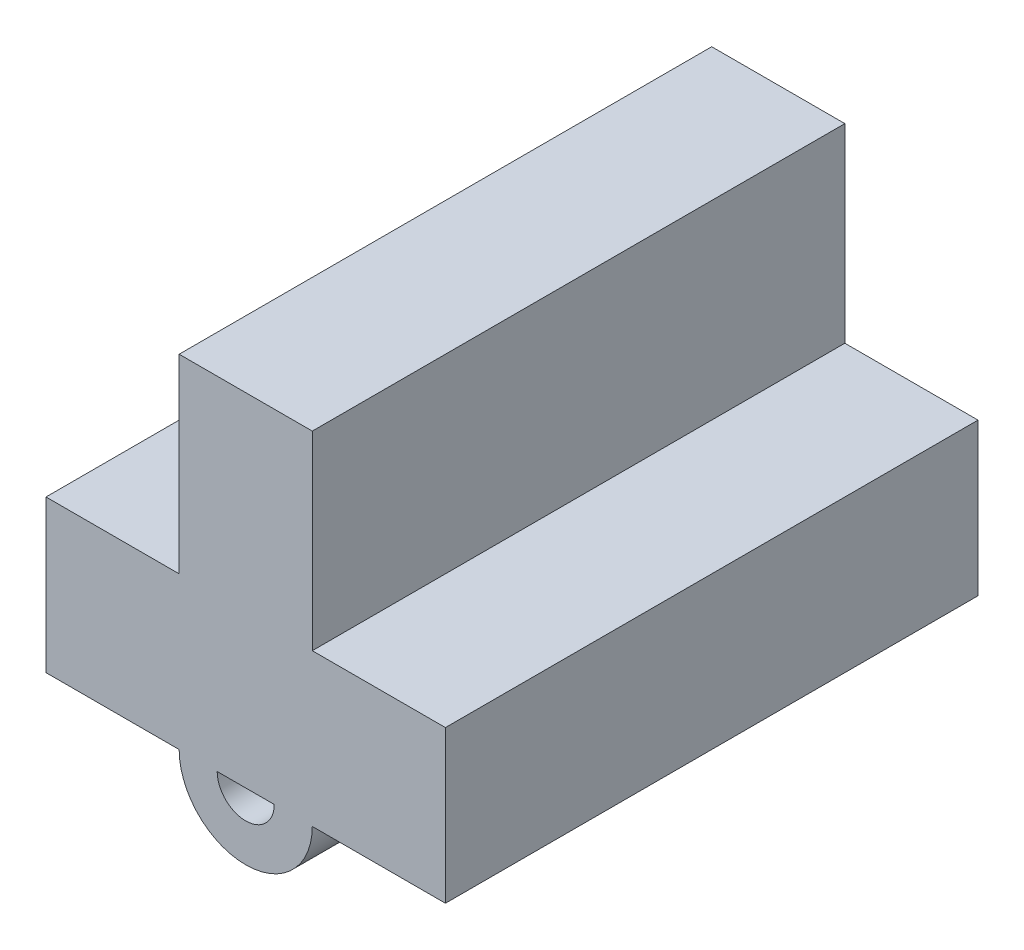
ISO-10303-21;
HEADER;
FILE_DESCRIPTION(('STEP AP214'),'2;1');
FILE_NAME('part.step','',(''),(''),'','','');
FILE_SCHEMA(('AUTOMOTIVE_DESIGN { 1 0 10303 214 1 1 1 1 }'));
ENDSEC;
DATA;
#1=APPLICATION_CONTEXT('core data for automotive mechanical design processes');
#2=APPLICATION_PROTOCOL_DEFINITION('international standard','automotive_design',2000,#1);
#3=PRODUCT_CONTEXT('',#1,'mechanical');
#4=PRODUCT('Part','Part','',(#3));
#5=PRODUCT_RELATED_PRODUCT_CATEGORY('part','',(#4));
#6=PRODUCT_DEFINITION_FORMATION('','',#4);
#7=PRODUCT_DEFINITION_CONTEXT('part definition',#1,'design');
#8=PRODUCT_DEFINITION('design','',#6,#7);
#9=PRODUCT_DEFINITION_SHAPE('','',#8);
#10=(LENGTH_UNIT() NAMED_UNIT(*) SI_UNIT(.MILLI.,.METRE.));
#11=(NAMED_UNIT(*) PLANE_ANGLE_UNIT() SI_UNIT($,.RADIAN.));
#12=(NAMED_UNIT(*) SI_UNIT($,.STERADIAN.) SOLID_ANGLE_UNIT());
#13=UNCERTAINTY_MEASURE_WITH_UNIT(LENGTH_MEASURE(1.E-05),#10,'distance_accuracy_value','');
#14=(GEOMETRIC_REPRESENTATION_CONTEXT(3) GLOBAL_UNCERTAINTY_ASSIGNED_CONTEXT((#13)) GLOBAL_UNIT_ASSIGNED_CONTEXT((#10,
#11,#12)) REPRESENTATION_CONTEXT('',''));
#15=CARTESIAN_POINT('',(0.,0.,0.));
#16=DIRECTION('',(0.,0.,1.));
#17=DIRECTION('',(1.,0.,0.));
#18=AXIS2_PLACEMENT_3D('',#15,#16,#17);
#19=CARTESIAN_POINT('',(1.75,2.,14.));
#20=DIRECTION('',(0.,-1.,0.));
#21=DIRECTION('',(0.,0.,-1.));
#22=AXIS2_PLACEMENT_3D('',#19,#20,#21);
#23=PLANE('',#22);
#24=DIRECTION('',(-1.,0.,0.));
#25=VECTOR('',#24,1.);
#26=CARTESIAN_POINT('',(1.75,2.,0.));
#27=LINE('',#26,#25);
#28=CARTESIAN_POINT('',(5.25,2.,0.));
#29=VERTEX_POINT('',#28);
#30=CARTESIAN_POINT('',(1.75,2.,0.));
#31=VERTEX_POINT('',#30);
#32=EDGE_CURVE('E195',#29,#31,#27,.T.);
#33=ORIENTED_EDGE('',*,*,#32,.T.);
#34=DIRECTION('',(0.,0.,-1.));
#35=VECTOR('',#34,1.);
#36=CARTESIAN_POINT('',(1.75,2.,14.));
#37=LINE('',#36,#35);
#38=CARTESIAN_POINT('',(1.75,2.,14.));
#39=VERTEX_POINT('',#38);
#40=EDGE_CURVE('E11',#39,#31,#37,.T.);
#41=ORIENTED_EDGE('',*,*,#40,.F.);
#42=DIRECTION('',(-1.,0.,0.));
#43=VECTOR('',#42,1.);
#44=CARTESIAN_POINT('',(1.75,2.,14.));
#45=LINE('',#44,#43);
#46=CARTESIAN_POINT('',(5.25,2.,14.));
#47=VERTEX_POINT('',#46);
#48=EDGE_CURVE('E167',#47,#39,#45,.T.);
#49=ORIENTED_EDGE('',*,*,#48,.F.);
#50=DIRECTION('',(0.,0.,-1.));
#51=VECTOR('',#50,1.);
#52=CARTESIAN_POINT('',(5.25,2.,14.));
#53=LINE('',#52,#51);
#54=EDGE_CURVE('E194',#47,#29,#53,.T.);
#55=ORIENTED_EDGE('',*,*,#54,.T.);
#56=EDGE_LOOP('',(#33,#41,#49,#55));
#57=FACE_BOUND('',#56,.T.);
#58=ADVANCED_FACE('F43',(#57),#23,.F.);
#59=CARTESIAN_POINT('',(1.75,2.,14.));
#60=DIRECTION('',(-1.,0.,0.));
#61=DIRECTION('',(0.,-1.,0.));
#62=AXIS2_PLACEMENT_3D('',#59,#60,#61);
#63=PLANE('',#62);
#64=DIRECTION('',(0.,1.,0.));
#65=VECTOR('',#64,1.);
#66=CARTESIAN_POINT('',(1.75,2.,0.));
#67=LINE('',#66,#65);
#68=CARTESIAN_POINT('',(1.75,7.,0.));
#69=VERTEX_POINT('',#68);
#70=EDGE_CURVE('E199',#31,#69,#67,.T.);
#71=ORIENTED_EDGE('',*,*,#70,.T.);
#72=DIRECTION('',(0.,0.,-1.));
#73=VECTOR('',#72,1.);
#74=CARTESIAN_POINT('',(1.75,7.,14.));
#75=LINE('',#74,#73);
#76=CARTESIAN_POINT('',(1.75,7.,14.));
#77=VERTEX_POINT('',#76);
#78=EDGE_CURVE('E51',#77,#69,#75,.T.);
#79=ORIENTED_EDGE('',*,*,#78,.F.);
#80=DIRECTION('',(0.,1.,0.));
#81=VECTOR('',#80,1.);
#82=CARTESIAN_POINT('',(1.75,2.,14.));
#83=LINE('',#82,#81);
#84=EDGE_CURVE('E171',#39,#77,#83,.T.);
#85=ORIENTED_EDGE('',*,*,#84,.F.);
#86=ORIENTED_EDGE('',*,*,#40,.T.);
#87=EDGE_LOOP('',(#71,#79,#85,#86));
#88=FACE_BOUND('',#87,.T.);
#89=ADVANCED_FACE('F269',(#88),#63,.F.);
#90=CARTESIAN_POINT('',(1.75,7.,14.));
#91=DIRECTION('',(0.,-1.,0.));
#92=DIRECTION('',(1.,0.,0.));
#93=AXIS2_PLACEMENT_3D('',#90,#91,#92);
#94=PLANE('',#93);
#95=DIRECTION('',(-1.,0.,0.));
#96=VECTOR('',#95,1.);
#97=CARTESIAN_POINT('',(1.75,7.,0.));
#98=LINE('',#97,#96);
#99=CARTESIAN_POINT('',(-1.75,7.,0.));
#100=VERTEX_POINT('',#99);
#101=EDGE_CURVE('E202',#69,#100,#98,.T.);
#102=ORIENTED_EDGE('',*,*,#101,.T.);
#103=DIRECTION('',(0.,0.,-1.));
#104=VECTOR('',#103,1.);
#105=CARTESIAN_POINT('',(-1.75,7.,14.));
#106=LINE('',#105,#104);
#107=CARTESIAN_POINT('',(-1.75,7.,14.));
#108=VERTEX_POINT('',#107);
#109=EDGE_CURVE('E238',#108,#100,#106,.T.);
#110=ORIENTED_EDGE('',*,*,#109,.F.);
#111=DIRECTION('',(-1.,0.,0.));
#112=VECTOR('',#111,1.);
#113=CARTESIAN_POINT('',(1.75,7.,14.));
#114=LINE('',#113,#112);
#115=EDGE_CURVE('E175',#77,#108,#114,.T.);
#116=ORIENTED_EDGE('',*,*,#115,.F.);
#117=ORIENTED_EDGE('',*,*,#78,.T.);
#118=EDGE_LOOP('',(#102,#110,#116,#117));
#119=FACE_BOUND('',#118,.T.);
#120=ADVANCED_FACE('F247',(#119),#94,.F.);
#121=CARTESIAN_POINT('',(-1.75,7.,14.));
#122=DIRECTION('',(1.,0.,0.));
#123=DIRECTION('',(0.,1.,0.));
#124=AXIS2_PLACEMENT_3D('',#121,#122,#123);
#125=PLANE('',#124);
#126=DIRECTION('',(0.,-1.,0.));
#127=VECTOR('',#126,1.);
#128=CARTESIAN_POINT('',(-1.75,7.,0.));
#129=LINE('',#128,#127);
#130=CARTESIAN_POINT('',(-1.75,2.,0.));
#131=VERTEX_POINT('',#130);
#132=EDGE_CURVE('E205',#100,#131,#129,.T.);
#133=ORIENTED_EDGE('',*,*,#132,.T.);
#134=DIRECTION('',(0.,0.,-1.));
#135=VECTOR('',#134,1.);
#136=CARTESIAN_POINT('',(-1.75,2.,14.));
#137=LINE('',#136,#135);
#138=CARTESIAN_POINT('',(-1.75,2.,14.));
#139=VERTEX_POINT('',#138);
#140=EDGE_CURVE('E234',#139,#131,#137,.T.);
#141=ORIENTED_EDGE('',*,*,#140,.F.);
#142=DIRECTION('',(0.,-1.,0.));
#143=VECTOR('',#142,1.);
#144=CARTESIAN_POINT('',(-1.75,7.,14.));
#145=LINE('',#144,#143);
#146=EDGE_CURVE('E178',#108,#139,#145,.T.);
#147=ORIENTED_EDGE('',*,*,#146,.F.);
#148=ORIENTED_EDGE('',*,*,#109,.T.);
#149=EDGE_LOOP('',(#133,#141,#147,#148));
#150=FACE_BOUND('',#149,.T.);
#151=ADVANCED_FACE('F258',(#150),#125,.F.);
#152=CARTESIAN_POINT('',(-5.25,2.,14.));
#153=DIRECTION('',(0.,-1.,0.));
#154=DIRECTION('',(0.,0.,-1.));
#155=AXIS2_PLACEMENT_3D('',#152,#153,#154);
#156=PLANE('',#155);
#157=DIRECTION('',(-1.,0.,0.));
#158=VECTOR('',#157,1.);
#159=CARTESIAN_POINT('',(-5.25,2.,0.));
#160=LINE('',#159,#158);
#161=CARTESIAN_POINT('',(-5.25,2.,0.));
#162=VERTEX_POINT('',#161);
#163=EDGE_CURVE('E208',#131,#162,#160,.T.);
#164=ORIENTED_EDGE('',*,*,#163,.T.);
#165=DIRECTION('',(0.,0.,-1.));
#166=VECTOR('',#165,1.);
#167=CARTESIAN_POINT('',(-5.25,2.,14.));
#168=LINE('',#167,#166);
#169=CARTESIAN_POINT('',(-5.25,2.,14.));
#170=VERTEX_POINT('',#169);
#171=EDGE_CURVE('E230',#170,#162,#168,.T.);
#172=ORIENTED_EDGE('',*,*,#171,.F.);
#173=DIRECTION('',(-1.,0.,0.));
#174=VECTOR('',#173,1.);
#175=CARTESIAN_POINT('',(-5.25,2.,14.));
#176=LINE('',#175,#174);
#177=EDGE_CURVE('E181',#139,#170,#176,.T.);
#178=ORIENTED_EDGE('',*,*,#177,.F.);
#179=ORIENTED_EDGE('',*,*,#140,.T.);
#180=EDGE_LOOP('',(#164,#172,#178,#179));
#181=FACE_BOUND('',#180,.T.);
#182=ADVANCED_FACE('F262',(#181),#156,.F.);
#183=CARTESIAN_POINT('',(-5.25,-2.,14.));
#184=DIRECTION('',(1.,0.,0.));
#185=DIRECTION('',(0.,1.,0.));
#186=AXIS2_PLACEMENT_3D('',#183,#184,#185);
#187=PLANE('',#186);
#188=DIRECTION('',(0.,-1.,0.));
#189=VECTOR('',#188,1.);
#190=CARTESIAN_POINT('',(-5.25,-2.,0.));
#191=LINE('',#190,#189);
#192=CARTESIAN_POINT('',(-5.25,-2.,0.));
#193=VERTEX_POINT('',#192);
#194=EDGE_CURVE('E211',#162,#193,#191,.T.);
#195=ORIENTED_EDGE('',*,*,#194,.T.);
#196=DIRECTION('',(0.,0.,-1.));
#197=VECTOR('',#196,1.);
#198=CARTESIAN_POINT('',(-5.25,-2.,14.));
#199=LINE('',#198,#197);
#200=CARTESIAN_POINT('',(-5.25,-2.,14.));
#201=VERTEX_POINT('',#200);
#202=EDGE_CURVE('E226',#201,#193,#199,.T.);
#203=ORIENTED_EDGE('',*,*,#202,.F.);
#204=DIRECTION('',(0.,-1.,0.));
#205=VECTOR('',#204,1.);
#206=CARTESIAN_POINT('',(-5.25,-2.,14.));
#207=LINE('',#206,#205);
#208=EDGE_CURVE('E184',#170,#201,#207,.T.);
#209=ORIENTED_EDGE('',*,*,#208,.F.);
#210=ORIENTED_EDGE('',*,*,#171,.T.);
#211=EDGE_LOOP('',(#195,#203,#209,#210));
#212=FACE_BOUND('',#211,.T.);
#213=ADVANCED_FACE('F279',(#212),#187,.F.);
#214=CARTESIAN_POINT('',(-5.25,-2.,14.));
#215=DIRECTION('',(0.,1.,0.));
#216=DIRECTION('',(0.,0.,1.));
#217=AXIS2_PLACEMENT_3D('',#214,#215,#216);
#218=PLANE('',#217);
#219=DIRECTION('',(-1.,0.,0.));
#220=VECTOR('',#219,1.);
#221=CARTESIAN_POINT('',(-1.75,-2.,9.));
#222=LINE('',#221,#220);
#223=CARTESIAN_POINT('',(-0.750000000000001,-2.,9.));
#224=VERTEX_POINT('',#223);
#225=CARTESIAN_POINT('',(-1.75,-2.,9.));
#226=VERTEX_POINT('',#225);
#227=EDGE_CURVE('E158',#224,#226,#222,.T.);
#228=ORIENTED_EDGE('',*,*,#227,.T.);
#229=DIRECTION('',(0.,0.,1.));
#230=VECTOR('',#229,1.);
#231=CARTESIAN_POINT('',(-1.75,-2.,9.));
#232=LINE('',#231,#230);
#233=CARTESIAN_POINT('',(-1.75,-2.,14.));
#234=VERTEX_POINT('',#233);
#235=EDGE_CURVE('E150',#226,#234,#232,.T.);
#236=ORIENTED_EDGE('',*,*,#235,.T.);
#237=DIRECTION('',(1.,0.,0.));
#238=VECTOR('',#237,1.);
#239=CARTESIAN_POINT('',(-5.25,-2.,14.));
#240=LINE('',#239,#238);
#241=EDGE_CURVE('E187',#201,#234,#240,.T.);
#242=ORIENTED_EDGE('',*,*,#241,.F.);
#243=ORIENTED_EDGE('',*,*,#202,.T.);
#244=DIRECTION('',(1.,0.,0.));
#245=VECTOR('',#244,1.);
#246=CARTESIAN_POINT('',(-5.25,-2.,0.));
#247=LINE('',#246,#245);
#248=CARTESIAN_POINT('',(5.25,-2.,0.));
#249=VERTEX_POINT('',#248);
#250=EDGE_CURVE('E214',#193,#249,#247,.T.);
#251=ORIENTED_EDGE('',*,*,#250,.T.);
#252=DIRECTION('',(0.,0.,-1.));
#253=VECTOR('',#252,1.);
#254=CARTESIAN_POINT('',(5.25,-2.,14.));
#255=LINE('',#254,#253);
#256=CARTESIAN_POINT('',(5.25,-2.,14.));
#257=VERTEX_POINT('',#256);
#258=EDGE_CURVE('E222',#257,#249,#255,.T.);
#259=ORIENTED_EDGE('',*,*,#258,.F.);
#260=CARTESIAN_POINT('',(1.75,-2.,14.));
#261=VERTEX_POINT('',#260);
#262=EDGE_CURVE('E155',#261,#257,#240,.T.);
#263=ORIENTED_EDGE('',*,*,#262,.F.);
#264=DIRECTION('',(0.,0.,1.));
#265=VECTOR('',#264,1.);
#266=CARTESIAN_POINT('',(1.75,-2.,9.));
#267=LINE('',#266,#265);
#268=CARTESIAN_POINT('',(1.75,-2.,9.));
#269=VERTEX_POINT('',#268);
#270=EDGE_CURVE('E147',#269,#261,#267,.T.);
#271=ORIENTED_EDGE('',*,*,#270,.F.);
#272=DIRECTION('',(-1.,0.,0.));
#273=VECTOR('',#272,1.);
#274=CARTESIAN_POINT('',(0.75,-2.,9.));
#275=LINE('',#274,#273);
#276=CARTESIAN_POINT('',(0.75,-2.,9.));
#277=VERTEX_POINT('',#276);
#278=EDGE_CURVE('E133',#269,#277,#275,.T.);
#279=ORIENTED_EDGE('',*,*,#278,.T.);
#280=DIRECTION('',(0.,0.,1.));
#281=VECTOR('',#280,1.);
#282=CARTESIAN_POINT('',(0.75,-2.,9.));
#283=LINE('',#282,#281);
#284=CARTESIAN_POINT('',(0.75,-2.,14.));
#285=VERTEX_POINT('',#284);
#286=EDGE_CURVE('E157',#277,#285,#283,.T.);
#287=ORIENTED_EDGE('',*,*,#286,.T.);
#288=CARTESIAN_POINT('',(-0.750000000000001,-2.,14.));
#289=VERTEX_POINT('',#288);
#290=EDGE_CURVE('E191',#289,#285,#240,.T.);
#291=ORIENTED_EDGE('',*,*,#290,.F.);
#292=DIRECTION('',(0.,0.,1.));
#293=VECTOR('',#292,1.);
#294=CARTESIAN_POINT('',(-0.750000000000001,-2.,9.));
#295=LINE('',#294,#293);
#296=EDGE_CURVE('E162',#224,#289,#295,.T.);
#297=ORIENTED_EDGE('',*,*,#296,.F.);
#298=EDGE_LOOP('',(#228,#236,#242,#243,#251,#259,#263,#271,#279,#287,#291,#297));
#299=FACE_BOUND('',#298,.T.);
#300=ADVANCED_FACE('F153',(#299),#218,.F.);
#301=CARTESIAN_POINT('',(5.25,-2.,14.));
#302=DIRECTION('',(-1.,0.,0.));
#303=DIRECTION('',(0.,-1.,0.));
#304=AXIS2_PLACEMENT_3D('',#301,#302,#303);
#305=PLANE('',#304);
#306=DIRECTION('',(0.,1.,0.));
#307=VECTOR('',#306,1.);
#308=CARTESIAN_POINT('',(5.25,-2.,0.));
#309=LINE('',#308,#307);
#310=EDGE_CURVE('E172',#249,#29,#309,.T.);
#311=ORIENTED_EDGE('',*,*,#310,.T.);
#312=ORIENTED_EDGE('',*,*,#54,.F.);
#313=DIRECTION('',(0.,1.,0.));
#314=VECTOR('',#313,1.);
#315=CARTESIAN_POINT('',(5.25,-2.,14.));
#316=LINE('',#315,#314);
#317=EDGE_CURVE('E190',#257,#47,#316,.T.);
#318=ORIENTED_EDGE('',*,*,#317,.F.);
#319=ORIENTED_EDGE('',*,*,#258,.T.);
#320=EDGE_LOOP('',(#311,#312,#318,#319));
#321=FACE_BOUND('',#320,.T.);
#322=ADVANCED_FACE('F275',(#321),#305,.F.);
#323=CARTESIAN_POINT('',(0.,0.,14.));
#324=DIRECTION('',(0.,0.,1.));
#325=DIRECTION('',(1.,0.,0.));
#326=AXIS2_PLACEMENT_3D('',#323,#324,#325);
#327=PLANE('',#326);
#328=ORIENTED_EDGE('',*,*,#241,.T.);
#329=CARTESIAN_POINT('',(0.,-2.,14.));
#330=DIRECTION('',(0.,0.,1.));
#331=DIRECTION('',(1.,0.,0.));
#332=AXIS2_PLACEMENT_3D('',#329,#330,#331);
#333=CIRCLE('',#332,1.75);
#334=EDGE_CURVE('E58',#234,#261,#333,.T.);
#335=ORIENTED_EDGE('',*,*,#334,.T.);
#336=ORIENTED_EDGE('',*,*,#262,.T.);
#337=ORIENTED_EDGE('',*,*,#317,.T.);
#338=ORIENTED_EDGE('',*,*,#48,.T.);
#339=ORIENTED_EDGE('',*,*,#84,.T.);
#340=ORIENTED_EDGE('',*,*,#115,.T.);
#341=ORIENTED_EDGE('',*,*,#146,.T.);
#342=ORIENTED_EDGE('',*,*,#177,.T.);
#343=ORIENTED_EDGE('',*,*,#208,.T.);
#344=EDGE_LOOP('',(#328,#335,#336,#337,#338,#339,#340,#341,#342,#343));
#345=FACE_BOUND('',#344,.T.);
#346=CARTESIAN_POINT('',(0.,-2.,14.));
#347=DIRECTION('',(0.,0.,-1.));
#348=DIRECTION('',(1.,0.,0.));
#349=AXIS2_PLACEMENT_3D('',#346,#347,#348);
#350=CIRCLE('',#349,0.75);
#351=EDGE_CURVE('E65',#285,#289,#350,.T.);
#352=ORIENTED_EDGE('',*,*,#351,.T.);
#353=ORIENTED_EDGE('',*,*,#290,.T.);
#354=EDGE_LOOP('',(#352,#353));
#355=FACE_BOUND('',#354,.T.);
#356=ADVANCED_FACE('F265',(#345,#355),#327,.T.);
#357=CARTESIAN_POINT('',(0.,0.,0.));
#358=DIRECTION('',(0.,0.,1.));
#359=DIRECTION('',(1.,0.,0.));
#360=AXIS2_PLACEMENT_3D('',#357,#358,#359);
#361=PLANE('',#360);
#362=ORIENTED_EDGE('',*,*,#32,.F.);
#363=ORIENTED_EDGE('',*,*,#310,.F.);
#364=ORIENTED_EDGE('',*,*,#250,.F.);
#365=ORIENTED_EDGE('',*,*,#194,.F.);
#366=ORIENTED_EDGE('',*,*,#163,.F.);
#367=ORIENTED_EDGE('',*,*,#132,.F.);
#368=ORIENTED_EDGE('',*,*,#101,.F.);
#369=ORIENTED_EDGE('',*,*,#70,.F.);
#370=EDGE_LOOP('',(#362,#363,#364,#365,#366,#367,#368,#369));
#371=FACE_BOUND('',#370,.T.);
#372=ADVANCED_FACE('F253',(#371),#361,.F.);
#373=CARTESIAN_POINT('',(0.,-2.,9.));
#374=DIRECTION('',(0.,0.,1.));
#375=DIRECTION('',(1.,0.,0.));
#376=AXIS2_PLACEMENT_3D('',#373,#374,#375);
#377=CYLINDRICAL_SURFACE('',#376,1.75);
#378=ORIENTED_EDGE('',*,*,#334,.F.);
#379=ORIENTED_EDGE('',*,*,#235,.F.);
#380=CARTESIAN_POINT('',(0.,-2.,9.));
#381=DIRECTION('',(0.,0.,1.));
#382=DIRECTION('',(1.,0.,0.));
#383=AXIS2_PLACEMENT_3D('',#380,#381,#382);
#384=CIRCLE('',#383,1.75);
#385=EDGE_CURVE('E137',#226,#269,#384,.T.);
#386=ORIENTED_EDGE('',*,*,#385,.T.);
#387=ORIENTED_EDGE('',*,*,#270,.T.);
#388=EDGE_LOOP('',(#378,#379,#386,#387));
#389=FACE_BOUND('',#388,.T.);
#390=ADVANCED_FACE('F146',(#389),#377,.T.);
#391=CARTESIAN_POINT('',(0.,-2.,9.));
#392=DIRECTION('',(0.,0.,1.));
#393=DIRECTION('',(1.,0.,0.));
#394=AXIS2_PLACEMENT_3D('',#391,#392,#393);
#395=CYLINDRICAL_SURFACE('',#394,0.75);
#396=ORIENTED_EDGE('',*,*,#351,.F.);
#397=ORIENTED_EDGE('',*,*,#286,.F.);
#398=CARTESIAN_POINT('',(0.,-2.,9.));
#399=DIRECTION('',(0.,0.,-1.));
#400=DIRECTION('',(1.,0.,0.));
#401=AXIS2_PLACEMENT_3D('',#398,#399,#400);
#402=CIRCLE('',#401,0.75);
#403=EDGE_CURVE('E139',#277,#224,#402,.T.);
#404=ORIENTED_EDGE('',*,*,#403,.T.);
#405=ORIENTED_EDGE('',*,*,#296,.T.);
#406=EDGE_LOOP('',(#396,#397,#404,#405));
#407=FACE_BOUND('',#406,.T.);
#408=ADVANCED_FACE('F355',(#407),#395,.F.);
#409=CARTESIAN_POINT('',(0.,-2.,9.));
#410=DIRECTION('',(0.,0.,1.));
#411=DIRECTION('',(1.,0.,0.));
#412=AXIS2_PLACEMENT_3D('',#409,#410,#411);
#413=PLANE('',#412);
#414=ORIENTED_EDGE('',*,*,#385,.F.);
#415=ORIENTED_EDGE('',*,*,#227,.F.);
#416=ORIENTED_EDGE('',*,*,#403,.F.);
#417=ORIENTED_EDGE('',*,*,#278,.F.);
#418=EDGE_LOOP('',(#414,#415,#416,#417));
#419=FACE_BOUND('',#418,.T.);
#420=ADVANCED_FACE('F135',(#419),#413,.F.);
#421=CLOSED_SHELL('',(#58,#89,#120,#151,#182,#213,#300,#322,#356,#372,#390,#408,#420));
#422=MANIFOLD_SOLID_BREP('B2',#421);
#423=ADVANCED_BREP_SHAPE_REPRESENTATION('',(#18,#422),#14);
#424=SHAPE_DEFINITION_REPRESENTATION(#9,#423);
ENDSEC;
END-ISO-10303-21;
